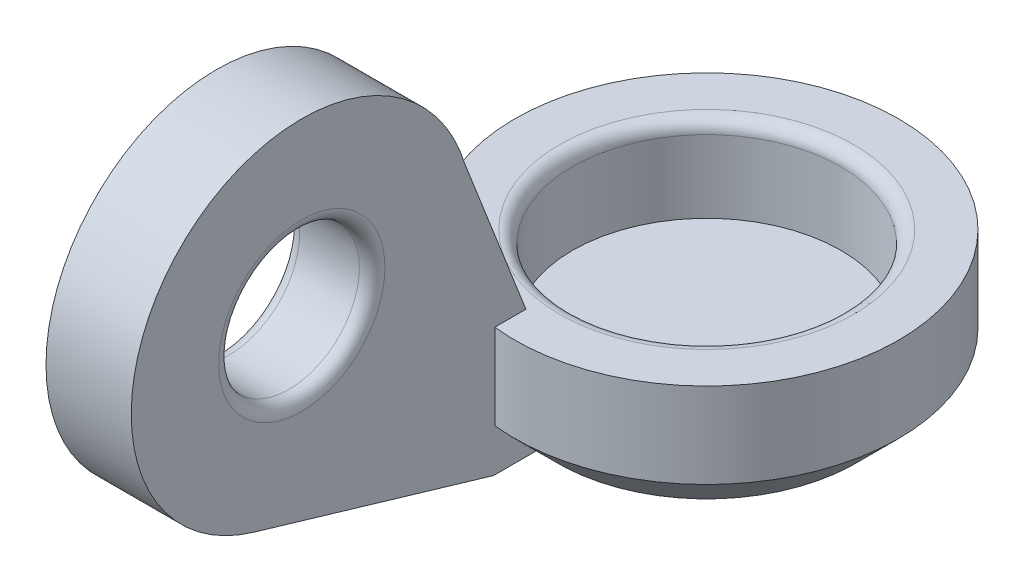
ISO-10303-21;
HEADER;
FILE_DESCRIPTION(('STEP AP214'),'2;1');
FILE_NAME('part.step','',(''),(''),'','','');
FILE_SCHEMA(('AUTOMOTIVE_DESIGN { 1 0 10303 214 1 1 1 1 }'));
ENDSEC;
DATA;
#1=APPLICATION_CONTEXT('core data for automotive mechanical design processes');
#2=APPLICATION_PROTOCOL_DEFINITION('international standard','automotive_design',2000,#1);
#3=PRODUCT_CONTEXT('',#1,'mechanical');
#4=PRODUCT('Part','Part','',(#3));
#5=PRODUCT_RELATED_PRODUCT_CATEGORY('part','',(#4));
#6=PRODUCT_DEFINITION_FORMATION('','',#4);
#7=PRODUCT_DEFINITION_CONTEXT('part definition',#1,'design');
#8=PRODUCT_DEFINITION('design','',#6,#7);
#9=PRODUCT_DEFINITION_SHAPE('','',#8);
#10=(LENGTH_UNIT() NAMED_UNIT(*) SI_UNIT(.MILLI.,.METRE.));
#11=(NAMED_UNIT(*) PLANE_ANGLE_UNIT() SI_UNIT($,.RADIAN.));
#12=(NAMED_UNIT(*) SI_UNIT($,.STERADIAN.) SOLID_ANGLE_UNIT());
#13=UNCERTAINTY_MEASURE_WITH_UNIT(LENGTH_MEASURE(1.E-05),#10,'distance_accuracy_value','');
#14=(GEOMETRIC_REPRESENTATION_CONTEXT(3) GLOBAL_UNCERTAINTY_ASSIGNED_CONTEXT((#13)) GLOBAL_UNIT_ASSIGNED_CONTEXT((#10,
#11,#12)) REPRESENTATION_CONTEXT('',''));
#15=CARTESIAN_POINT('',(0.,0.,0.));
#16=DIRECTION('',(0.,0.,1.));
#17=DIRECTION('',(1.,0.,0.));
#18=AXIS2_PLACEMENT_3D('',#15,#16,#17);
#19=CARTESIAN_POINT('',(0.,-2.,0.));
#20=DIRECTION('',(0.,1.,0.));
#21=DIRECTION('',(0.,0.,1.));
#22=AXIS2_PLACEMENT_3D('',#19,#20,#21);
#23=CONICAL_SURFACE('',#22,4.5,0.785398163397448);
#24=CARTESIAN_POINT('',(-0.5,1.84455672578068,-8.32956343092311));
#25=CARTESIAN_POINT('',(-0.5,1.56050708483777,-8.04499841482449));
#26=CARTESIAN_POINT('',(-0.5,1.27647978357437,-7.76041108292257));
#27=CARTESIAN_POINT('',(-0.5,0.708494530276033,-7.19115924221696));
#28=CARTESIAN_POINT('',(-0.5,0.424536579272096,-6.9064947323846));
#29=CARTESIAN_POINT('',(-0.5,-0.143366592922138,-6.33697445829595));
#30=CARTESIAN_POINT('',(-0.5,-0.427311782030489,-6.0521186620469));
#31=CARTESIAN_POINT('',(-0.5,-0.99504439296968,-5.48225763399936));
#32=CARTESIAN_POINT('',(-0.5,-1.27883181691005,-5.19725240430306));
#33=CARTESIAN_POINT('',(-0.5,-1.85350048784624,-4.61961401126448));
#34=CARTESIAN_POINT('',(-0.5,-2.14437521348103,-4.32697435992691));
#35=CARTESIAN_POINT('',(-0.5,-2.72568264848801,-3.74123232923193));
#36=CARTESIAN_POINT('',(-0.5,-3.01611533948948,-3.44812993162163));
#37=CARTESIAN_POINT('',(-0.5,-3.45101484407144,-3.00779367353851));
#38=CARTESIAN_POINT('',(-0.5,-3.5958419470033,-2.86091589775715));
#39=CARTESIAN_POINT('',(-0.5,-3.88511250907444,-2.5667782458169));
#40=CARTESIAN_POINT('',(-0.5,-4.02955596186184,-2.41951836341051));
#41=CARTESIAN_POINT('',(-0.5,-4.31779936005582,-2.12438992089171));
#42=CARTESIAN_POINT('',(-0.5,-4.46159935309042,-1.9765214074385));
#43=CARTESIAN_POINT('',(-0.5,-4.67638345410784,-1.75383844803434));
#44=CARTESIAN_POINT('',(-0.5,-4.7478245591479,-1.67946509501682));
#45=CARTESIAN_POINT('',(-0.5,-4.89025485207228,-1.53028723892495));
#46=CARTESIAN_POINT('',(-0.5,-4.96124404443078,-1.4554827401332));
#47=CARTESIAN_POINT('',(-0.5,-5.07000750791339,-1.33980093696933));
#48=CARTESIAN_POINT('',(-0.5,-5.10802939419686,-1.29915655648828));
#49=CARTESIAN_POINT('',(-0.5,-5.18380610610896,-1.21761815713421));
#50=CARTESIAN_POINT('',(-0.5,-5.22156092781463,-1.17672413461052));
#51=CARTESIAN_POINT('',(-0.5,-5.29663063086563,-1.09470121937531));
#52=CARTESIAN_POINT('',(-0.5,-5.33394630544709,-1.0535730536634));
#53=CARTESIAN_POINT('',(-0.5,-5.4080886195102,-0.970879040266312));
#54=CARTESIAN_POINT('',(-0.5,-5.44491527362126,-0.929313205741325));
#55=CARTESIAN_POINT('',(-0.5,-5.52762414048717,-0.834384107956916));
#56=CARTESIAN_POINT('',(-0.5,-5.57329582917367,-0.780837081168954));
#57=CARTESIAN_POINT('',(-0.5,-5.66298120195017,-0.671994253754087));
#58=CARTESIAN_POINT('',(-0.5,-5.70698786566927,-0.616692540626108));
#59=CARTESIAN_POINT('',(-0.5,-5.77053081956287,-0.531487144997089));
#60=CARTESIAN_POINT('',(-0.5,-5.79138824788977,-0.502575514403177));
#61=CARTESIAN_POINT('',(-0.5,-5.83179128884024,-0.4438042162966));
#62=CARTESIAN_POINT('',(-0.5,-5.85133580834869,-0.413943788558022));
#63=CARTESIAN_POINT('',(-0.5,-5.88834818027311,-0.353126256983285));
#64=CARTESIAN_POINT('',(-0.5,-5.90582507990371,-0.322174763370816));
#65=CARTESIAN_POINT('',(-0.5,-5.93768505638904,-0.258745893671859));
#66=CARTESIAN_POINT('',(-0.5,-5.95207398030669,-0.226271545814342));
#67=CARTESIAN_POINT('',(-0.5,-5.97621978956839,-0.159155788096467));
#68=CARTESIAN_POINT('',(-0.5,-5.98592616732087,-0.124495118782898));
#69=CARTESIAN_POINT('',(-0.5,-5.99825618722708,-0.0540707572158387));
#70=CARTESIAN_POINT('',(-0.5,-6.00092668456852,-0.0183159743105536));
#71=CARTESIAN_POINT('',(-0.5,-5.99847296288625,0.0529727404849206));
#72=CARTESIAN_POINT('',(-0.5,-5.99333303669486,0.0885060826566771));
#73=CARTESIAN_POINT('',(-0.5,-5.97668577394989,0.158195198760665));
#74=CARTESIAN_POINT('',(-0.5,-5.96513274108427,0.192339176893906));
#75=CARTESIAN_POINT('',(-0.5,-5.93480061320678,0.266130071703718));
#76=CARTESIAN_POINT('',(-0.5,-5.91499056608467,0.305333351929589));
#77=CARTESIAN_POINT('',(-0.5,-5.87173301819547,0.381718062786176));
#78=CARTESIAN_POINT('',(-0.5,-5.84827634554093,0.418894066949211));
#79=CARTESIAN_POINT('',(-0.5,-5.79904777256703,0.492002214262168));
#80=CARTESIAN_POINT('',(-0.5,-5.77326208689647,0.527924934770371));
#81=CARTESIAN_POINT('',(-0.5,-5.72034083480357,0.598677113662614));
#82=CARTESIAN_POINT('',(-0.5,-5.693207038772,0.633507912775811));
#83=CARTESIAN_POINT('',(-0.5,-5.61526342578271,0.730888910563142));
#84=CARTESIAN_POINT('',(-0.5,-5.56339737759493,0.792588848604165));
#85=CARTESIAN_POINT('',(-0.5,-5.45807538778561,0.914622329290568));
#86=CARTESIAN_POINT('',(-0.5,-5.40461902580731,0.974955503110521));
#87=CARTESIAN_POINT('',(-0.5,-5.29669100088894,1.09482119858602));
#88=CARTESIAN_POINT('',(-0.5,-5.2422183237578,1.15435280578165));
#89=CARTESIAN_POINT('',(-0.5,-5.1326630069678,1.27283652130572));
#90=CARTESIAN_POINT('',(-0.5,-5.07758044090649,1.33178869796985));
#91=CARTESIAN_POINT('',(-0.5,-4.91224351989638,1.50750201236674));
#92=CARTESIAN_POINT('',(-0.5,-4.80137950667479,1.62368876701915));
#93=CARTESIAN_POINT('',(-0.5,-4.57886581880136,1.85519380298763));
#94=CARTESIAN_POINT('',(-0.5,-4.46721655566742,1.97051248189618));
#95=CARTESIAN_POINT('',(-0.5,-4.20942801301285,2.23561094395497));
#96=CARTESIAN_POINT('',(-0.5,-4.06311268923825,2.3852194961621));
#97=CARTESIAN_POINT('',(-0.5,-3.76998412402506,2.68399035736643));
#98=CARTESIAN_POINT('',(-0.5,-3.62317081235265,2.83315259731562));
#99=CARTESIAN_POINT('',(-0.5,-3.32909014568224,3.1313379525699));
#100=CARTESIAN_POINT('',(-0.5,-3.18182247577289,3.28036075725725));
#101=CARTESIAN_POINT('',(-0.5,-2.88709482362797,3.57820377206648));
#102=CARTESIAN_POINT('',(-0.5,-2.73963484959933,3.72702399031365));
#103=CARTESIAN_POINT('',(-0.5,-2.42510048872422,4.0441650280635));
#104=CARTESIAN_POINT('',(-0.5,-2.25800665731583,4.21246656038625));
#105=CARTESIAN_POINT('',(-0.5,-1.92369386295978,4.54894917647072));
#106=CARTESIAN_POINT('',(-0.5,-1.75647489857406,4.71713025880332));
#107=CARTESIAN_POINT('',(-0.5,-1.25481985182567,5.22140770810821));
#108=CARTESIAN_POINT('',(-0.5,-0.920251946824391,5.55737292667038));
#109=CARTESIAN_POINT('',(-0.5,-0.185731867548644,6.29453206406151));
#110=CARTESIAN_POINT('',(-0.5,0.214262034476446,6.69568438979152));
#111=CARTESIAN_POINT('',(-0.5,1.01459926683641,7.49799356471106));
#112=CARTESIAN_POINT('',(-0.5,1.41494267347706,7.89915033778905));
#113=CARTESIAN_POINT('',(-0.5,1.81531964439593,8.30027353696713));
#114=B_SPLINE_CURVE_WITH_KNOTS('',3,(#24,#25,#26,#27,#28,#29,#30,#31,#32,#33,#34,#35,#36,#37,
#38,#39,#40,#41,#42,#43,#44,#45,#46,#47,#48,#49,#50,#51,#52,#53,#54,#55,#56,#57,#58,#59,#60,#61,
#62,#63,#64,#65,#66,#67,#68,#69,#70,#71,#72,#73,#74,#75,#76,#77,#78,#79,#80,#81,#82,#83,#84,#85,
#86,#87,#88,#89,#90,#91,#92,#93,#94,#95,#96,#97,#98,#99,#100,#101,#102,#103,#104,#105,#106,#107,
#108,#109,#110,#111,#112,#113),.UNSPECIFIED.,.F.,.F.,(4,2,2,2,2,2,2,2,2,2,2,2,2,2,2,2,2,2,2,2,2,
2,2,2,2,2,2,2,2,2,2,2,2,2,2,2,2,2,2,2,2,2,2,2,4),(0.,1.20621435242465,2.41244566123549,
3.61905627978482,4.82565035643883,6.06347679806063,7.30135335025228,7.92016760723653,
8.53899204649839,9.15776989730009,9.46715056596943,9.77652816681766,9.94349636452863,
10.1104670098003,10.2770653596704,10.4436587143424,10.6547799123228,10.8667097318165,
10.9736349158873,11.0806480488248,11.1871741029436,11.2934966353278,11.4009416903207,
11.5076693888429,11.6146120065518,11.7223266062877,11.853757802166,11.9855250840214,
12.1181310144811,12.2505671816149,12.4923168125491,12.7341309214143,12.9762008266608,
13.2182418320816,13.700011127738,14.1815443966626,14.8093301583688,15.4372084829039,
16.0657461983655,16.6942579145561,17.4057434372674,18.1172372661971,19.5396557314697,
21.2391452464389,22.9393846734594),.UNSPECIFIED.);
#115=CARTESIAN_POINT('',(-0.5,-3.,3.46410161513775));
#116=VERTEX_POINT('',#115);
#117=CARTESIAN_POINT('',(-0.5,-2.,4.47213595499958));
#118=VERTEX_POINT('',#117);
#119=EDGE_CURVE('E159',#116,#118,#114,.T.);
#120=ORIENTED_EDGE('',*,*,#119,.F.);
#121=CARTESIAN_POINT('',(0.,-3.,0.));
#122=DIRECTION('',(0.,1.,0.));
#123=DIRECTION('',(0.,0.,1.));
#124=AXIS2_PLACEMENT_3D('',#121,#122,#123);
#125=CIRCLE('',#124,3.5);
#126=CARTESIAN_POINT('',(-2.5,-3.,2.44948974278318));
#127=VERTEX_POINT('',#126);
#128=EDGE_CURVE('E139',#116,#127,#125,.T.);
#129=ORIENTED_EDGE('',*,*,#128,.T.);
#130=CARTESIAN_POINT('',(-2.5,2.62537239341259,-8.77624186759097));
#131=CARTESIAN_POINT('',(-2.5,2.45532686204164,-8.59942389655475));
#132=CARTESIAN_POINT('',(-2.5,2.28547397593831,-8.42242013726825));
#133=CARTESIAN_POINT('',(-2.5,1.94624926182495,-8.0679493474952));
#134=CARTESIAN_POINT('',(-2.5,1.77687743805998,-7.89048231294689));
#135=CARTESIAN_POINT('',(-2.5,1.43866067607728,-7.53494073884856));
#136=CARTESIAN_POINT('',(-2.5,1.26981591941549,-7.35686602649842));
#137=CARTESIAN_POINT('',(-2.5,0.932841839792324,-7.00004182107414));
#138=CARTESIAN_POINT('',(-2.5,0.764712514228827,-6.82129233045872));
#139=CARTESIAN_POINT('',(-2.5,0.430766547477874,-6.46447546975868));
#140=CARTESIAN_POINT('',(-2.5,0.264942380185847,-6.286415148316));
#141=CARTESIAN_POINT('',(-2.5,-0.0655927638383192,-5.92926454193018));
#142=CARTESIAN_POINT('',(-2.5,-0.230303745247746,-5.75017426132048));
#143=CARTESIAN_POINT('',(-2.5,-0.558263151063855,-5.39070085892808));
#144=CARTESIAN_POINT('',(-2.5,-0.721511763612765,-5.21031790898999));
#145=CARTESIAN_POINT('',(-2.5,-1.04609776936607,-4.84784273816462));
#146=CARTESIAN_POINT('',(-2.5,-1.2074352023583,-4.66575055300296));
#147=CARTESIAN_POINT('',(-2.5,-1.48404599494157,-4.3490238571088));
#148=CARTESIAN_POINT('',(-2.5,-1.59993366034814,-4.21492644916895));
#149=CARTESIAN_POINT('',(-2.5,-1.82992756674574,-3.94519341122693));
#150=CARTESIAN_POINT('',(-2.5,-1.94403368734428,-3.80955767832861));
#151=CARTESIAN_POINT('',(-2.5,-2.17049957995706,-3.53561211597668));
#152=CARTESIAN_POINT('',(-2.5,-2.2828468187155,-3.39729189365955));
#153=CARTESIAN_POINT('',(-2.5,-2.50432038039213,-3.11812233830049));
#154=CARTESIAN_POINT('',(-2.5,-2.61344724512665,-2.9772734371875));
#155=CARTESIAN_POINT('',(-2.5,-2.82817074901362,-2.69098375461344));
#156=CARTESIAN_POINT('',(-2.5,-2.93372876691941,-2.54551382405584));
#157=CARTESIAN_POINT('',(-2.5,-3.13838703401993,-2.24985681163713));
#158=CARTESIAN_POINT('',(-2.5,-3.23748171553703,-2.09966582374475));
#159=CARTESIAN_POINT('',(-2.5,-3.4252732208908,-1.79400530737046));
#160=CARTESIAN_POINT('',(-2.5,-3.51402525687041,-1.63857011748645));
#161=CARTESIAN_POINT('',(-2.5,-3.67625211618313,-1.31995606951551));
#162=CARTESIAN_POINT('',(-2.5,-3.74975772041651,-1.15679364679773));
#163=CARTESIAN_POINT('',(-2.5,-3.83884070532115,-0.914632875530704));
#164=CARTESIAN_POINT('',(-2.5,-3.86393646429119,-0.83914148757603));
#165=CARTESIAN_POINT('',(-2.5,-3.90848771122169,-0.686489202153973));
#166=CARTESIAN_POINT('',(-2.5,-3.92794338394794,-0.609328359465924));
#167=CARTESIAN_POINT('',(-2.5,-3.96026154184952,-0.453897392597565));
#168=CARTESIAN_POINT('',(-2.5,-3.97314663196761,-0.375632036741169));
#169=CARTESIAN_POINT('',(-2.5,-3.99170800593505,-0.21824406017463));
#170=CARTESIAN_POINT('',(-2.5,-3.99738501867,-0.139121526959008));
#171=CARTESIAN_POINT('',(-2.5,-4.00119023636275,0.0197496047483457));
#172=CARTESIAN_POINT('',(-2.5,-3.99927622884941,0.0994992360076441));
#173=CARTESIAN_POINT('',(-2.5,-3.98792693941288,0.258456175830423));
#174=CARTESIAN_POINT('',(-2.5,-3.97849119012075,0.337663450385709));
#175=CARTESIAN_POINT('',(-2.5,-3.95262595988836,0.495147110585215));
#176=CARTESIAN_POINT('',(-2.5,-3.93617612628186,0.573420100386687));
#177=CARTESIAN_POINT('',(-2.5,-3.89712240856814,0.72842629456631));
#178=CARTESIAN_POINT('',(-2.5,-3.87451579881143,0.805158800768309));
#179=CARTESIAN_POINT('',(-2.5,-3.81383108482149,0.987746946736327));
#180=CARTESIAN_POINT('',(-2.5,-3.77320039781125,1.09275012656053));
#181=CARTESIAN_POINT('',(-2.5,-3.68404978504835,1.29933589908505));
#182=CARTESIAN_POINT('',(-2.5,-3.63552596619295,1.40091677381601));
#183=CARTESIAN_POINT('',(-2.5,-3.5324276106022,1.60121005826891));
#184=CARTESIAN_POINT('',(-2.5,-3.47784000593763,1.6999156707114));
#185=CARTESIAN_POINT('',(-2.5,-3.36416856068681,1.89464390025878));
#186=CARTESIAN_POINT('',(-2.5,-3.3050858396643,1.99066717733951));
#187=CARTESIAN_POINT('',(-2.5,-3.1495554604418,2.2334792524369));
#188=CARTESIAN_POINT('',(-2.5,-3.05065699098487,2.37869190466841));
#189=CARTESIAN_POINT('',(-2.5,-2.8472198362771,2.6651314028905));
#190=CARTESIAN_POINT('',(-2.5,-2.74267921630092,2.80635685603766));
#191=CARTESIAN_POINT('',(-2.5,-2.52952235646906,3.08591507615983));
#192=CARTESIAN_POINT('',(-2.5,-2.42090201378568,3.22424470076945));
#193=CARTESIAN_POINT('',(-2.5,-2.20076719402405,3.49858408373473));
#194=CARTESIAN_POINT('',(-2.5,-2.08925254686146,3.63459370497308));
#195=CARTESIAN_POINT('',(-2.5,-1.86388814878397,3.90501260292795));
#196=CARTESIAN_POINT('',(-2.5,-1.75003508548807,4.03941911200735));
#197=CARTESIAN_POINT('',(-2.5,-1.52065803564957,4.30680232898979));
#198=CARTESIAN_POINT('',(-2.5,-1.4051339996097,4.43977899433399));
#199=CARTESIAN_POINT('',(-2.5,-1.05677810194326,4.836828106147));
#200=CARTESIAN_POINT('',(-2.5,-0.822010003706293,5.09920042636675));
#201=CARTESIAN_POINT('',(-2.5,-0.357579597979248,5.61164109003173));
#202=CARTESIAN_POINT('',(-2.5,-0.12803306236707,5.86181493358573));
#203=CARTESIAN_POINT('',(-2.5,0.333262079894573,6.36021736148205));
#204=CARTESIAN_POINT('',(-2.5,0.565011127765062,6.60844553707359));
#205=CARTESIAN_POINT('',(-2.5,1.02860577757195,7.10190290541815));
#206=CARTESIAN_POINT('',(-2.5,1.26044176562337,7.34714114681969));
#207=CARTESIAN_POINT('',(-2.5,1.72522369193856,7.83645198023402));
#208=CARTESIAN_POINT('',(-2.5,1.95816935002065,8.08052483825432));
#209=CARTESIAN_POINT('',(-2.5,2.19151702101936,8.32420975989128));
#210=B_SPLINE_CURVE_WITH_KNOTS('',3,(#130,#131,#132,#133,#134,#135,#136,#137,#138,#139,#140,
#141,#142,#143,#144,#145,#146,#147,#148,#149,#150,#151,#152,#153,#154,#155,#156,#157,#158,#159,
#160,#161,#162,#163,#164,#165,#166,#167,#168,#169,#170,#171,#172,#173,#174,#175,#176,#177,#178,
#179,#180,#181,#182,#183,#184,#185,#186,#187,#188,#189,#190,#191,#192,#193,#194,#195,#196,#197,
#198,#199,#200,#201,#202,#203,#204,#205,#206,#207,#208,#209),.UNSPECIFIED.,.F.,.F.,(4,2,2,2,2,2,
2,2,2,2,2,2,2,2,2,2,2,2,2,2,2,2,2,2,2,2,2,2,2,2,2,2,2,2,2,2,2,2,2,4),(0.,0.735949258687007,
1.47190499160842,2.20809113399568,2.94427459648893,3.67422178378698,4.4041659021477,
5.13401471980858,5.8638483163357,6.39554008686045,6.92726763365697,7.46182634222686,
7.99629459443896,8.53537806862466,9.07491995126682,9.61143506907622,10.1468562450731,
10.385340198542,10.6238163385383,10.861466412123,11.0990924524591,11.3380417415312,
11.5770058790497,11.8166681852488,12.0564367646467,12.3937545516366,12.7312392200414,
13.0694658462401,13.407608507002,13.9344654352589,14.4615041879956,14.9890879543799,
15.516702794836,16.0451250757079,16.5735630416013,17.6297297364615,18.648296684882,
19.6670721704672,20.6794947128856,21.6916739092562),.UNSPECIFIED.);
#211=CARTESIAN_POINT('',(-2.5,-2.,3.74165738677394));
#212=VERTEX_POINT('',#211);
#213=EDGE_CURVE('E151',#127,#212,#210,.T.);
#214=ORIENTED_EDGE('',*,*,#213,.T.);
#215=CARTESIAN_POINT('',(0.,-2.,0.));
#216=DIRECTION('',(0.,1.,0.));
#217=DIRECTION('',(0.,0.,1.));
#218=AXIS2_PLACEMENT_3D('',#215,#216,#217);
#219=CIRCLE('',#218,4.5);
#220=EDGE_CURVE('E142',#118,#212,#219,.T.);
#221=ORIENTED_EDGE('',*,*,#220,.F.);
#222=EDGE_LOOP('',(#120,#129,#214,#221));
#223=FACE_BOUND('',#222,.T.);
#224=ADVANCED_FACE('F41',(#223),#23,.T.);
#225=CARTESIAN_POINT('',(0.,-3.,0.));
#226=DIRECTION('',(0.,1.,0.));
#227=DIRECTION('',(0.,0.,1.));
#228=AXIS2_PLACEMENT_3D('',#225,#226,#227);
#229=CYLINDRICAL_SURFACE('',#228,4.5);
#230=DIRECTION('',(0.,1.,0.));
#231=VECTOR('',#230,1.);
#232=CARTESIAN_POINT('',(-0.5,-3.,4.47213595499958));
#233=LINE('',#232,#231);
#234=CARTESIAN_POINT('',(-0.5,0.,4.47213595499958));
#235=VERTEX_POINT('',#234);
#236=EDGE_CURVE('E64',#118,#235,#233,.T.);
#237=ORIENTED_EDGE('',*,*,#236,.F.);
#238=ORIENTED_EDGE('',*,*,#220,.T.);
#239=DIRECTION('',(0.,1.,0.));
#240=VECTOR('',#239,1.);
#241=CARTESIAN_POINT('',(-2.5,-3.,3.74165738677394));
#242=LINE('',#241,#240);
#243=CARTESIAN_POINT('',(-2.5,0.,3.74165738677394));
#244=VERTEX_POINT('',#243);
#245=EDGE_CURVE('E56',#212,#244,#242,.T.);
#246=ORIENTED_EDGE('',*,*,#245,.T.);
#247=CARTESIAN_POINT('',(0.,0.,0.));
#248=DIRECTION('',(0.,1.,0.));
#249=DIRECTION('',(0.,0.,1.));
#250=AXIS2_PLACEMENT_3D('',#247,#248,#249);
#251=CIRCLE('',#250,4.5);
#252=EDGE_CURVE('E148',#235,#244,#251,.T.);
#253=ORIENTED_EDGE('',*,*,#252,.F.);
#254=EDGE_LOOP('',(#237,#238,#246,#253));
#255=FACE_BOUND('',#254,.T.);
#256=ADVANCED_FACE('F190',(#255),#229,.T.);
#257=CARTESIAN_POINT('',(0.,0.,0.));
#258=DIRECTION('',(0.,1.,0.));
#259=DIRECTION('',(0.,0.,1.));
#260=AXIS2_PLACEMENT_3D('',#257,#258,#259);
#261=PLANE('',#260);
#262=CARTESIAN_POINT('',(0.,0.,0.));
#263=DIRECTION('',(0.,1.,0.));
#264=DIRECTION('',(0.,0.,1.));
#265=AXIS2_PLACEMENT_3D('',#262,#263,#264);
#266=CIRCLE('',#265,3.45);
#267=CARTESIAN_POINT('',(0.,0.,3.45));
#268=VERTEX_POINT('',#267);
#269=EDGE_CURVE('E237',#268,#268,#266,.F.);
#270=ORIENTED_EDGE('',*,*,#269,.T.);
#271=EDGE_LOOP('',(#270));
#272=FACE_BOUND('',#271,.T.);
#273=DIRECTION('',(0.,0.,-1.));
#274=VECTOR('',#273,1.);
#275=CARTESIAN_POINT('',(-0.5,0.,0.));
#276=LINE('',#275,#274);
#277=CARTESIAN_POINT('',(-0.5,0.,3.74165738677394));
#278=VERTEX_POINT('',#277);
#279=EDGE_CURVE('E114',#235,#278,#276,.T.);
#280=ORIENTED_EDGE('',*,*,#279,.F.);
#281=ORIENTED_EDGE('',*,*,#252,.T.);
#282=DIRECTION('',(-1.,0.,0.));
#283=VECTOR('',#282,1.);
#284=CARTESIAN_POINT('',(4.501,0.,3.74165738677394));
#285=LINE('',#284,#283);
#286=EDGE_CURVE('E120',#278,#244,#285,.T.);
#287=ORIENTED_EDGE('',*,*,#286,.F.);
#288=EDGE_LOOP('',(#280,#281,#287));
#289=FACE_BOUND('',#288,.T.);
#290=ADVANCED_FACE('F195',(#272,#289),#261,.T.);
#291=CARTESIAN_POINT('',(0.,-2.,0.));
#292=DIRECTION('',(0.,1.,0.));
#293=DIRECTION('',(0.,0.,1.));
#294=AXIS2_PLACEMENT_3D('',#291,#292,#293);
#295=CYLINDRICAL_SURFACE('',#294,3.15);
#296=CARTESIAN_POINT('',(0.,-0.3,0.));
#297=DIRECTION('',(0.,1.,0.));
#298=DIRECTION('',(0.,0.,1.));
#299=AXIS2_PLACEMENT_3D('',#296,#297,#298);
#300=CIRCLE('',#299,3.15);
#301=CARTESIAN_POINT('',(0.,-0.3,3.15));
#302=VERTEX_POINT('',#301);
#303=EDGE_CURVE('E201',#302,#302,#300,.T.);
#304=ORIENTED_EDGE('',*,*,#303,.T.);
#305=EDGE_LOOP('',(#304));
#306=FACE_BOUND('',#305,.T.);
#307=CARTESIAN_POINT('',(0.,-2.,0.));
#308=DIRECTION('',(0.,1.,0.));
#309=DIRECTION('',(0.,0.,1.));
#310=AXIS2_PLACEMENT_3D('',#307,#308,#309);
#311=CIRCLE('',#310,3.15);
#312=CARTESIAN_POINT('',(0.,-2.,3.15));
#313=VERTEX_POINT('',#312);
#314=EDGE_CURVE('E145',#313,#313,#311,.T.);
#315=ORIENTED_EDGE('',*,*,#314,.F.);
#316=EDGE_LOOP('',(#315));
#317=FACE_BOUND('',#316,.T.);
#318=ADVANCED_FACE('F209',(#306,#317),#295,.F.);
#319=CARTESIAN_POINT('',(0.,-2.,0.));
#320=DIRECTION('',(0.,1.,0.));
#321=DIRECTION('',(0.,0.,1.));
#322=AXIS2_PLACEMENT_3D('',#319,#320,#321);
#323=PLANE('',#322);
#324=ORIENTED_EDGE('',*,*,#314,.T.);
#325=EDGE_LOOP('',(#324));
#326=FACE_BOUND('',#325,.T.);
#327=ADVANCED_FACE('F185',(#326),#323,.T.);
#328=CARTESIAN_POINT('',(0.,-3.,0.));
#329=DIRECTION('',(0.,1.,0.));
#330=DIRECTION('',(0.,0.,1.));
#331=AXIS2_PLACEMENT_3D('',#328,#329,#330);
#332=PLANE('',#331);
#333=ORIENTED_EDGE('',*,*,#128,.F.);
#334=DIRECTION('',(0.,0.,-1.));
#335=VECTOR('',#334,1.);
#336=CARTESIAN_POINT('',(-0.5,-3.,3.5));
#337=LINE('',#336,#335);
#338=CARTESIAN_POINT('',(-0.5,-3.,4.5));
#339=VERTEX_POINT('',#338);
#340=EDGE_CURVE('E107',#339,#116,#337,.T.);
#341=ORIENTED_EDGE('',*,*,#340,.F.);
#342=DIRECTION('',(1.,0.,0.));
#343=VECTOR('',#342,1.);
#344=CARTESIAN_POINT('',(-11.9249380146998,-3.,4.5));
#345=LINE('',#344,#343);
#346=CARTESIAN_POINT('',(-2.5,-3.,4.5));
#347=VERTEX_POINT('',#346);
#348=EDGE_CURVE('E129',#347,#339,#345,.T.);
#349=ORIENTED_EDGE('',*,*,#348,.F.);
#350=DIRECTION('',(0.,0.,1.));
#351=VECTOR('',#350,1.);
#352=CARTESIAN_POINT('',(-2.5,-3.,3.5));
#353=LINE('',#352,#351);
#354=EDGE_CURVE('E128',#127,#347,#353,.T.);
#355=ORIENTED_EDGE('',*,*,#354,.F.);
#356=EDGE_LOOP('',(#333,#341,#349,#355));
#357=FACE_BOUND('',#356,.T.);
#358=ADVANCED_FACE('F180',(#357),#332,.F.);
#359=CARTESIAN_POINT('',(-11.9249380146998,-3.,4.5));
#360=DIRECTION('',(0.,-0.959039906535825,0.283270996877119));
#361=DIRECTION('',(0.,-0.283270996877119,-0.959039906535825));
#362=AXIS2_PLACEMENT_3D('',#359,#360,#361);
#363=PLANE('',#362);
#364=DIRECTION('',(0.,0.283270996877119,0.959039906535825));
#365=VECTOR('',#364,1.);
#366=CARTESIAN_POINT('',(-2.5,-3.,4.5));
#367=LINE('',#366,#365);
#368=CARTESIAN_POINT('',(-2.5,-1.3361596261433,10.1330839875085));
#369=VERTEX_POINT('',#368);
#370=EDGE_CURVE('E125',#347,#369,#367,.T.);
#371=ORIENTED_EDGE('',*,*,#370,.F.);
#372=ORIENTED_EDGE('',*,*,#348,.T.);
#373=DIRECTION('',(0.,-0.283270996877119,-0.959039906535825));
#374=VECTOR('',#373,1.);
#375=CARTESIAN_POINT('',(-0.5,-3.,4.5));
#376=LINE('',#375,#374);
#377=CARTESIAN_POINT('',(-0.5,-1.3361596261433,10.1330839875085));
#378=VERTEX_POINT('',#377);
#379=EDGE_CURVE('E131',#378,#339,#376,.T.);
#380=ORIENTED_EDGE('',*,*,#379,.F.);
#381=DIRECTION('',(1.,0.,0.));
#382=VECTOR('',#381,1.);
#383=CARTESIAN_POINT('',(-11.9249380146998,-1.3361596261433,10.1330839875085));
#384=LINE('',#383,#382);
#385=EDGE_CURVE('E118',#369,#378,#384,.T.);
#386=ORIENTED_EDGE('',*,*,#385,.F.);
#387=EDGE_LOOP('',(#371,#372,#380,#386));
#388=FACE_BOUND('',#387,.T.);
#389=ADVANCED_FACE('F177',(#388),#363,.T.);
#390=CARTESIAN_POINT('',(-0.5,0.,0.));
#391=DIRECTION('',(1.,0.,0.));
#392=DIRECTION('',(0.,0.,-1.));
#393=AXIS2_PLACEMENT_3D('',#390,#391,#392);
#394=PLANE('',#393);
#395=CARTESIAN_POINT('',(-0.5,2.5,9.));
#396=DIRECTION('',(1.,0.,0.));
#397=DIRECTION('',(0.,0.,-1.));
#398=AXIS2_PLACEMENT_3D('',#395,#396,#397);
#399=CIRCLE('',#398,1.95);
#400=CARTESIAN_POINT('',(-0.5,2.5,7.05));
#401=VERTEX_POINT('',#400);
#402=EDGE_CURVE('E232',#401,#401,#399,.F.);
#403=ORIENTED_EDGE('',*,*,#402,.T.);
#404=EDGE_LOOP('',(#403));
#405=FACE_BOUND('',#404,.T.);
#406=DIRECTION('',(0.,0.931503025211058,0.363733575605343));
#407=VECTOR('',#406,1.);
#408=CARTESIAN_POINT('',(-0.5,3.67258617243512,5.17572991693657));
#409=LINE('',#408,#407);
#410=CARTESIAN_POINT('',(-0.5,3.67258617243512,5.17572991693657));
#411=VERTEX_POINT('',#410);
#412=EDGE_CURVE('E101',#278,#411,#409,.T.);
#413=ORIENTED_EDGE('',*,*,#412,.T.);
#414=CARTESIAN_POINT('',(-0.5,2.5,9.));
#415=DIRECTION('',(1.,0.,0.));
#416=DIRECTION('',(0.,0.,-1.));
#417=AXIS2_PLACEMENT_3D('',#414,#415,#416);
#418=CIRCLE('',#417,4.);
#419=EDGE_CURVE('E112',#411,#378,#418,.T.);
#420=ORIENTED_EDGE('',*,*,#419,.T.);
#421=ORIENTED_EDGE('',*,*,#379,.T.);
#422=ORIENTED_EDGE('',*,*,#340,.T.);
#423=ORIENTED_EDGE('',*,*,#119,.T.);
#424=ORIENTED_EDGE('',*,*,#236,.T.);
#425=ORIENTED_EDGE('',*,*,#279,.T.);
#426=EDGE_LOOP('',(#413,#420,#421,#422,#423,#424,#425));
#427=FACE_BOUND('',#426,.T.);
#428=ADVANCED_FACE('F110',(#405,#427),#394,.T.);
#429=CARTESIAN_POINT('',(-2.5,2.5,9.));
#430=DIRECTION('',(1.,0.,0.));
#431=DIRECTION('',(0.,0.,-1.));
#432=AXIS2_PLACEMENT_3D('',#429,#430,#431);
#433=PLANE('',#432);
#434=CARTESIAN_POINT('',(-2.5,2.5,9.));
#435=DIRECTION('',(1.,0.,0.));
#436=DIRECTION('',(0.,0.,-1.));
#437=AXIS2_PLACEMENT_3D('',#434,#435,#436);
#438=CIRCLE('',#437,1.95);
#439=CARTESIAN_POINT('',(-2.5,2.5,7.05));
#440=VERTEX_POINT('',#439);
#441=EDGE_CURVE('E49',#440,#440,#438,.T.);
#442=ORIENTED_EDGE('',*,*,#441,.T.);
#443=EDGE_LOOP('',(#442));
#444=FACE_BOUND('',#443,.T.);
#445=CARTESIAN_POINT('',(-2.5,2.5,9.));
#446=DIRECTION('',(1.,0.,0.));
#447=DIRECTION('',(0.,0.,-1.));
#448=AXIS2_PLACEMENT_3D('',#445,#446,#447);
#449=CIRCLE('',#448,4.);
#450=CARTESIAN_POINT('',(-2.5,3.67258617243512,5.17572991693657));
#451=VERTEX_POINT('',#450);
#452=EDGE_CURVE('E108',#451,#369,#449,.T.);
#453=ORIENTED_EDGE('',*,*,#452,.F.);
#454=DIRECTION('',(0.,0.931503025211058,0.363733575605342));
#455=VECTOR('',#454,1.);
#456=CARTESIAN_POINT('',(-2.5,3.67258617243512,5.17572991693657));
#457=LINE('',#456,#455);
#458=EDGE_CURVE('E103',#244,#451,#457,.T.);
#459=ORIENTED_EDGE('',*,*,#458,.F.);
#460=ORIENTED_EDGE('',*,*,#245,.F.);
#461=ORIENTED_EDGE('',*,*,#213,.F.);
#462=ORIENTED_EDGE('',*,*,#354,.T.);
#463=ORIENTED_EDGE('',*,*,#370,.T.);
#464=EDGE_LOOP('',(#453,#459,#460,#461,#462,#463));
#465=FACE_BOUND('',#464,.T.);
#466=ADVANCED_FACE('F169',(#444,#465),#433,.F.);
#467=CARTESIAN_POINT('',(-2.5,2.5,9.));
#468=DIRECTION('',(1.,0.,0.));
#469=DIRECTION('',(0.,0.,-1.));
#470=AXIS2_PLACEMENT_3D('',#467,#468,#469);
#471=CYLINDRICAL_SURFACE('',#470,4.);
#472=ORIENTED_EDGE('',*,*,#452,.T.);
#473=ORIENTED_EDGE('',*,*,#385,.T.);
#474=ORIENTED_EDGE('',*,*,#419,.F.);
#475=DIRECTION('',(1.,0.,0.));
#476=VECTOR('',#475,1.);
#477=CARTESIAN_POINT('',(-2.5,3.67258617243512,5.17572991693657));
#478=LINE('',#477,#476);
#479=EDGE_CURVE('E98',#411,#451,#478,.F.);
#480=ORIENTED_EDGE('',*,*,#479,.T.);
#481=EDGE_LOOP('',(#472,#473,#474,#480));
#482=FACE_BOUND('',#481,.T.);
#483=ADVANCED_FACE('F116',(#482),#471,.T.);
#484=CARTESIAN_POINT('',(-2.5,2.5,9.));
#485=DIRECTION('',(1.,0.,0.));
#486=DIRECTION('',(0.,0.,-1.));
#487=AXIS2_PLACEMENT_3D('',#484,#485,#486);
#488=CYLINDRICAL_SURFACE('',#487,1.65);
#489=CARTESIAN_POINT('',(-2.2,2.5,9.));
#490=DIRECTION('',(1.,0.,0.));
#491=DIRECTION('',(0.,0.,-1.));
#492=AXIS2_PLACEMENT_3D('',#489,#490,#491);
#493=CIRCLE('',#492,1.65);
#494=CARTESIAN_POINT('',(-2.2,2.5,7.35));
#495=VERTEX_POINT('',#494);
#496=EDGE_CURVE('E12',#495,#495,#493,.F.);
#497=ORIENTED_EDGE('',*,*,#496,.T.);
#498=EDGE_LOOP('',(#497));
#499=FACE_BOUND('',#498,.T.);
#500=CARTESIAN_POINT('',(-0.8,2.5,9.));
#501=DIRECTION('',(1.,0.,0.));
#502=DIRECTION('',(0.,0.,-1.));
#503=AXIS2_PLACEMENT_3D('',#500,#501,#502);
#504=CIRCLE('',#503,1.65);
#505=CARTESIAN_POINT('',(-0.8,2.5,7.35));
#506=VERTEX_POINT('',#505);
#507=EDGE_CURVE('E235',#506,#506,#504,.T.);
#508=ORIENTED_EDGE('',*,*,#507,.T.);
#509=EDGE_LOOP('',(#508));
#510=FACE_BOUND('',#509,.T.);
#511=ADVANCED_FACE('F279',(#499,#510),#488,.F.);
#512=CARTESIAN_POINT('',(4.501,3.67258617243512,5.17572991693657));
#513=DIRECTION('',(0.,-0.363733575605342,0.931503025211058));
#514=DIRECTION('',(0.,-0.931503025211058,-0.363733575605343));
#515=AXIS2_PLACEMENT_3D('',#512,#513,#514);
#516=PLANE('',#515);
#517=ORIENTED_EDGE('',*,*,#286,.T.);
#518=ORIENTED_EDGE('',*,*,#458,.T.);
#519=ORIENTED_EDGE('',*,*,#479,.F.);
#520=ORIENTED_EDGE('',*,*,#412,.F.);
#521=EDGE_LOOP('',(#517,#518,#519,#520));
#522=FACE_BOUND('',#521,.T.);
#523=ADVANCED_FACE('F100',(#522),#516,.F.);
#524=CARTESIAN_POINT('',(0.,-0.3,0.));
#525=DIRECTION('',(0.,1.,0.));
#526=DIRECTION('',(0.,0.,1.));
#527=AXIS2_PLACEMENT_3D('',#524,#525,#526);
#528=TOROIDAL_SURFACE('',#527,3.45,0.3);
#529=ORIENTED_EDGE('',*,*,#269,.F.);
#530=EDGE_LOOP('',(#529));
#531=FACE_BOUND('',#530,.T.);
#532=ORIENTED_EDGE('',*,*,#303,.F.);
#533=EDGE_LOOP('',(#532));
#534=FACE_BOUND('',#533,.T.);
#535=ADVANCED_FACE('F219',(#531,#534),#528,.T.);
#536=CARTESIAN_POINT('',(-0.8,2.5,9.));
#537=DIRECTION('',(1.,0.,0.));
#538=DIRECTION('',(0.,0.,-1.));
#539=AXIS2_PLACEMENT_3D('',#536,#537,#538);
#540=TOROIDAL_SURFACE('',#539,1.95,0.3);
#541=ORIENTED_EDGE('',*,*,#402,.F.);
#542=EDGE_LOOP('',(#541));
#543=FACE_BOUND('',#542,.T.);
#544=ORIENTED_EDGE('',*,*,#507,.F.);
#545=EDGE_LOOP('',(#544));
#546=FACE_BOUND('',#545,.T.);
#547=ADVANCED_FACE('F221',(#543,#546),#540,.T.);
#548=CARTESIAN_POINT('',(-2.2,2.5,9.));
#549=DIRECTION('',(1.,0.,0.));
#550=DIRECTION('',(0.,0.,-1.));
#551=AXIS2_PLACEMENT_3D('',#548,#549,#550);
#552=TOROIDAL_SURFACE('',#551,1.95,0.3);
#553=ORIENTED_EDGE('',*,*,#496,.F.);
#554=EDGE_LOOP('',(#553));
#555=FACE_BOUND('',#554,.T.);
#556=ORIENTED_EDGE('',*,*,#441,.F.);
#557=EDGE_LOOP('',(#556));
#558=FACE_BOUND('',#557,.T.);
#559=ADVANCED_FACE('F43',(#555,#558),#552,.T.);
#560=CLOSED_SHELL('',(#224,#256,#290,#318,#327,#358,#389,#428,#466,#483,#511,#523,#535,#547,#559));
#561=MANIFOLD_SOLID_BREP('B2',#560);
#562=ADVANCED_BREP_SHAPE_REPRESENTATION('',(#18,#561),#14);
#563=SHAPE_DEFINITION_REPRESENTATION(#9,#562);
ENDSEC;
END-ISO-10303-21;
